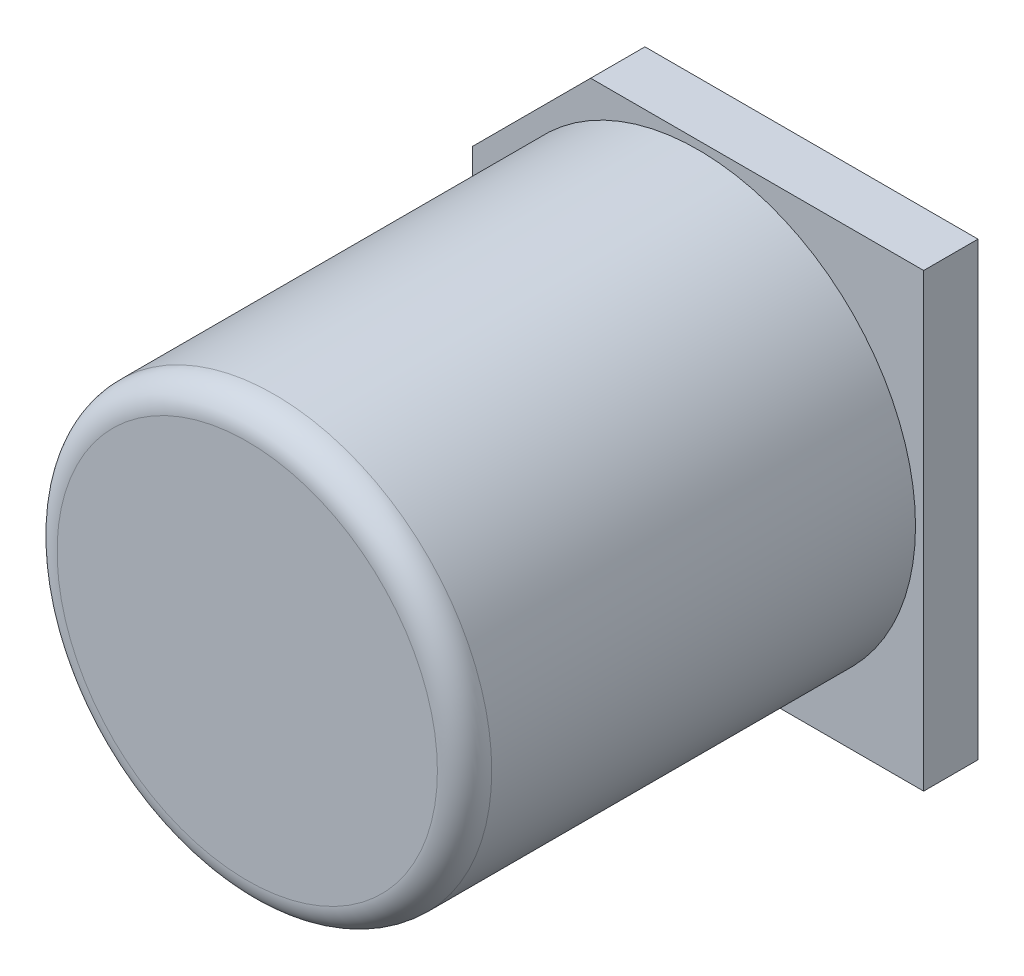
ISO-10303-21;
HEADER;
FILE_DESCRIPTION(('STEP AP214'),'2;1');
FILE_NAME('part.step','',(''),(''),'','','');
FILE_SCHEMA(('AUTOMOTIVE_DESIGN { 1 0 10303 214 1 1 1 1 }'));
ENDSEC;
DATA;
#1=APPLICATION_CONTEXT('core data for automotive mechanical design processes');
#2=APPLICATION_PROTOCOL_DEFINITION('international standard','automotive_design',2000,#1);
#3=PRODUCT_CONTEXT('',#1,'mechanical');
#4=PRODUCT('Part','Part','',(#3));
#5=PRODUCT_RELATED_PRODUCT_CATEGORY('part','',(#4));
#6=PRODUCT_DEFINITION_FORMATION('','',#4);
#7=PRODUCT_DEFINITION_CONTEXT('part definition',#1,'design');
#8=PRODUCT_DEFINITION('design','',#6,#7);
#9=PRODUCT_DEFINITION_SHAPE('','',#8);
#10=(LENGTH_UNIT() NAMED_UNIT(*) SI_UNIT(.MILLI.,.METRE.));
#11=(NAMED_UNIT(*) PLANE_ANGLE_UNIT() SI_UNIT($,.RADIAN.));
#12=(NAMED_UNIT(*) SI_UNIT($,.STERADIAN.) SOLID_ANGLE_UNIT());
#13=UNCERTAINTY_MEASURE_WITH_UNIT(LENGTH_MEASURE(1.E-05),#10,'distance_accuracy_value','');
#14=(GEOMETRIC_REPRESENTATION_CONTEXT(3) GLOBAL_UNCERTAINTY_ASSIGNED_CONTEXT((#13)) GLOBAL_UNIT_ASSIGNED_CONTEXT((#10,
#11,#12)) REPRESENTATION_CONTEXT('',''));
#15=CARTESIAN_POINT('',(0.,0.,0.));
#16=DIRECTION('',(0.,0.,1.));
#17=DIRECTION('',(1.,0.,0.));
#18=AXIS2_PLACEMENT_3D('',#15,#16,#17);
#19=CARTESIAN_POINT('',(4.15,4.15,1.));
#20=DIRECTION('',(-1.,0.,0.));
#21=DIRECTION('',(0.,0.,1.));
#22=AXIS2_PLACEMENT_3D('',#19,#20,#21);
#23=PLANE('',#22);
#24=DIRECTION('',(0.,1.,0.));
#25=VECTOR('',#24,1.);
#26=CARTESIAN_POINT('',(4.15,4.15,0.));
#27=LINE('',#26,#25);
#28=CARTESIAN_POINT('',(4.15,-4.15,0.));
#29=VERTEX_POINT('',#28);
#30=CARTESIAN_POINT('',(4.15,4.15,0.));
#31=VERTEX_POINT('',#30);
#32=EDGE_CURVE('E132',#29,#31,#27,.T.);
#33=ORIENTED_EDGE('',*,*,#32,.T.);
#34=DIRECTION('',(0.,0.,-1.));
#35=VECTOR('',#34,1.);
#36=CARTESIAN_POINT('',(4.15,4.15,1.));
#37=LINE('',#36,#35);
#38=CARTESIAN_POINT('',(4.15,4.15,1.));
#39=VERTEX_POINT('',#38);
#40=EDGE_CURVE('E149',#39,#31,#37,.T.);
#41=ORIENTED_EDGE('',*,*,#40,.F.);
#42=DIRECTION('',(0.,1.,0.));
#43=VECTOR('',#42,1.);
#44=CARTESIAN_POINT('',(4.15,4.15,1.));
#45=LINE('',#44,#43);
#46=CARTESIAN_POINT('',(4.15,-4.15,1.));
#47=VERTEX_POINT('',#46);
#48=EDGE_CURVE('E142',#47,#39,#45,.T.);
#49=ORIENTED_EDGE('',*,*,#48,.F.);
#50=DIRECTION('',(0.,0.,-1.));
#51=VECTOR('',#50,1.);
#52=CARTESIAN_POINT('',(4.15,-4.15,1.));
#53=LINE('',#52,#51);
#54=EDGE_CURVE('E128',#47,#29,#53,.T.);
#55=ORIENTED_EDGE('',*,*,#54,.T.);
#56=EDGE_LOOP('',(#33,#41,#49,#55));
#57=FACE_BOUND('',#56,.T.);
#58=ADVANCED_FACE('F46',(#57),#23,.F.);
#59=CARTESIAN_POINT('',(4.15,4.15,1.));
#60=DIRECTION('',(0.,-1.,0.));
#61=DIRECTION('',(1.,0.,0.));
#62=AXIS2_PLACEMENT_3D('',#59,#60,#61);
#63=PLANE('',#62);
#64=DIRECTION('',(-1.,0.,0.));
#65=VECTOR('',#64,1.);
#66=CARTESIAN_POINT('',(4.15,4.15,0.));
#67=LINE('',#66,#65);
#68=CARTESIAN_POINT('',(-1.98,4.15,0.));
#69=VERTEX_POINT('',#68);
#70=EDGE_CURVE('E135',#31,#69,#67,.T.);
#71=ORIENTED_EDGE('',*,*,#70,.T.);
#72=DIRECTION('',(0.,0.,-1.));
#73=VECTOR('',#72,1.);
#74=CARTESIAN_POINT('',(-1.98,4.15,1.));
#75=LINE('',#74,#73);
#76=CARTESIAN_POINT('',(-1.98,4.15,1.));
#77=VERTEX_POINT('',#76);
#78=EDGE_CURVE('E146',#77,#69,#75,.T.);
#79=ORIENTED_EDGE('',*,*,#78,.F.);
#80=DIRECTION('',(-1.,0.,0.));
#81=VECTOR('',#80,1.);
#82=CARTESIAN_POINT('',(4.15,4.15,1.));
#83=LINE('',#82,#81);
#84=EDGE_CURVE('E101',#39,#77,#83,.T.);
#85=ORIENTED_EDGE('',*,*,#84,.F.);
#86=ORIENTED_EDGE('',*,*,#40,.T.);
#87=EDGE_LOOP('',(#71,#79,#85,#86));
#88=FACE_BOUND('',#87,.T.);
#89=ADVANCED_FACE('F162',(#88),#63,.F.);
#90=CARTESIAN_POINT('',(-1.98,4.15,1.));
#91=DIRECTION('',(0.707106781186548,-0.707106781186547,0.));
#92=DIRECTION('',(0.707106781186547,0.707106781186548,0.));
#93=AXIS2_PLACEMENT_3D('',#90,#91,#92);
#94=PLANE('',#93);
#95=DIRECTION('',(-0.707106781186547,-0.707106781186548,0.));
#96=VECTOR('',#95,1.);
#97=CARTESIAN_POINT('',(-1.98,4.15,0.));
#98=LINE('',#97,#96);
#99=CARTESIAN_POINT('',(-4.15,1.98,0.));
#100=VERTEX_POINT('',#99);
#101=EDGE_CURVE('E137',#69,#100,#98,.T.);
#102=ORIENTED_EDGE('',*,*,#101,.T.);
#103=DIRECTION('',(0.,0.,-1.));
#104=VECTOR('',#103,1.);
#105=CARTESIAN_POINT('',(-4.15,1.98,1.));
#106=LINE('',#105,#104);
#107=CARTESIAN_POINT('',(-4.15,1.98,1.));
#108=VERTEX_POINT('',#107);
#109=EDGE_CURVE('E123',#108,#100,#106,.T.);
#110=ORIENTED_EDGE('',*,*,#109,.F.);
#111=DIRECTION('',(-0.707106781186547,-0.707106781186548,0.));
#112=VECTOR('',#111,1.);
#113=CARTESIAN_POINT('',(-1.98,4.15,1.));
#114=LINE('',#113,#112);
#115=EDGE_CURVE('E114',#77,#108,#114,.T.);
#116=ORIENTED_EDGE('',*,*,#115,.F.);
#117=ORIENTED_EDGE('',*,*,#78,.T.);
#118=EDGE_LOOP('',(#102,#110,#116,#117));
#119=FACE_BOUND('',#118,.T.);
#120=ADVANCED_FACE('F165',(#119),#94,.F.);
#121=CARTESIAN_POINT('',(-4.15,1.98,1.));
#122=DIRECTION('',(1.,0.,0.));
#123=DIRECTION('',(0.,1.,0.));
#124=AXIS2_PLACEMENT_3D('',#121,#122,#123);
#125=PLANE('',#124);
#126=DIRECTION('',(0.,-1.,0.));
#127=VECTOR('',#126,1.);
#128=CARTESIAN_POINT('',(-4.15,1.98,0.));
#129=LINE('',#128,#127);
#130=CARTESIAN_POINT('',(-4.15,-1.98,0.));
#131=VERTEX_POINT('',#130);
#132=EDGE_CURVE('E122',#100,#131,#129,.T.);
#133=ORIENTED_EDGE('',*,*,#132,.T.);
#134=DIRECTION('',(0.,0.,-1.));
#135=VECTOR('',#134,1.);
#136=CARTESIAN_POINT('',(-4.15,-1.98,1.));
#137=LINE('',#136,#135);
#138=CARTESIAN_POINT('',(-4.15,-1.98,1.));
#139=VERTEX_POINT('',#138);
#140=EDGE_CURVE('E119',#139,#131,#137,.T.);
#141=ORIENTED_EDGE('',*,*,#140,.F.);
#142=DIRECTION('',(0.,-1.,0.));
#143=VECTOR('',#142,1.);
#144=CARTESIAN_POINT('',(-4.15,1.98,1.));
#145=LINE('',#144,#143);
#146=EDGE_CURVE('E108',#108,#139,#145,.T.);
#147=ORIENTED_EDGE('',*,*,#146,.F.);
#148=ORIENTED_EDGE('',*,*,#109,.T.);
#149=EDGE_LOOP('',(#133,#141,#147,#148));
#150=FACE_BOUND('',#149,.T.);
#151=ADVANCED_FACE('F120',(#150),#125,.F.);
#152=CARTESIAN_POINT('',(-1.98,-4.15,1.));
#153=DIRECTION('',(0.707106781186547,0.707106781186548,0.));
#154=DIRECTION('',(-0.707106781186548,0.707106781186547,0.));
#155=AXIS2_PLACEMENT_3D('',#152,#153,#154);
#156=PLANE('',#155);
#157=DIRECTION('',(0.707106781186548,-0.707106781186547,0.));
#158=VECTOR('',#157,1.);
#159=CARTESIAN_POINT('',(-1.98,-4.15,0.));
#160=LINE('',#159,#158);
#161=CARTESIAN_POINT('',(-1.98,-4.15,0.));
#162=VERTEX_POINT('',#161);
#163=EDGE_CURVE('E86',#131,#162,#160,.T.);
#164=ORIENTED_EDGE('',*,*,#163,.T.);
#165=DIRECTION('',(0.,0.,-1.));
#166=VECTOR('',#165,1.);
#167=CARTESIAN_POINT('',(-1.98,-4.15,1.));
#168=LINE('',#167,#166);
#169=CARTESIAN_POINT('',(-1.98,-4.15,1.));
#170=VERTEX_POINT('',#169);
#171=EDGE_CURVE('E124',#170,#162,#168,.T.);
#172=ORIENTED_EDGE('',*,*,#171,.F.);
#173=DIRECTION('',(0.707106781186548,-0.707106781186547,0.));
#174=VECTOR('',#173,1.);
#175=CARTESIAN_POINT('',(-1.98,-4.15,1.));
#176=LINE('',#175,#174);
#177=EDGE_CURVE('E112',#139,#170,#176,.T.);
#178=ORIENTED_EDGE('',*,*,#177,.F.);
#179=ORIENTED_EDGE('',*,*,#140,.T.);
#180=EDGE_LOOP('',(#164,#172,#178,#179));
#181=FACE_BOUND('',#180,.T.);
#182=ADVANCED_FACE('F126',(#181),#156,.F.);
#183=CARTESIAN_POINT('',(4.15,-4.15,1.));
#184=DIRECTION('',(0.,1.,0.));
#185=DIRECTION('',(-1.,0.,0.));
#186=AXIS2_PLACEMENT_3D('',#183,#184,#185);
#187=PLANE('',#186);
#188=DIRECTION('',(1.,0.,0.));
#189=VECTOR('',#188,1.);
#190=CARTESIAN_POINT('',(4.15,-4.15,0.));
#191=LINE('',#190,#189);
#192=EDGE_CURVE('E92',#162,#29,#191,.T.);
#193=ORIENTED_EDGE('',*,*,#192,.T.);
#194=ORIENTED_EDGE('',*,*,#54,.F.);
#195=DIRECTION('',(1.,0.,0.));
#196=VECTOR('',#195,1.);
#197=CARTESIAN_POINT('',(4.15,-4.15,1.));
#198=LINE('',#197,#196);
#199=EDGE_CURVE('E63',#170,#47,#198,.T.);
#200=ORIENTED_EDGE('',*,*,#199,.F.);
#201=ORIENTED_EDGE('',*,*,#171,.T.);
#202=EDGE_LOOP('',(#193,#194,#200,#201));
#203=FACE_BOUND('',#202,.T.);
#204=ADVANCED_FACE('F170',(#203),#187,.F.);
#205=CARTESIAN_POINT('',(0.,0.,1.));
#206=DIRECTION('',(0.,0.,-1.));
#207=DIRECTION('',(-1.,0.,0.));
#208=AXIS2_PLACEMENT_3D('',#205,#206,#207);
#209=PLANE('',#208);
#210=CARTESIAN_POINT('',(0.,0.,1.));
#211=DIRECTION('',(0.,0.,1.));
#212=DIRECTION('',(1.,0.,0.));
#213=AXIS2_PLACEMENT_3D('',#210,#211,#212);
#214=CIRCLE('',#213,4.);
#215=CARTESIAN_POINT('',(4.,0.,1.));
#216=VERTEX_POINT('',#215);
#217=EDGE_CURVE('E150',#216,#216,#214,.T.);
#218=ORIENTED_EDGE('',*,*,#217,.F.);
#219=EDGE_LOOP('',(#218));
#220=FACE_BOUND('',#219,.T.);
#221=ORIENTED_EDGE('',*,*,#48,.T.);
#222=ORIENTED_EDGE('',*,*,#84,.T.);
#223=ORIENTED_EDGE('',*,*,#115,.T.);
#224=ORIENTED_EDGE('',*,*,#146,.T.);
#225=ORIENTED_EDGE('',*,*,#177,.T.);
#226=ORIENTED_EDGE('',*,*,#199,.T.);
#227=EDGE_LOOP('',(#221,#222,#223,#224,#225,#226));
#228=FACE_BOUND('',#227,.T.);
#229=ADVANCED_FACE('F110',(#220,#228),#209,.F.);
#230=CARTESIAN_POINT('',(0.,0.,0.));
#231=DIRECTION('',(0.,0.,-1.));
#232=DIRECTION('',(-1.,0.,0.));
#233=AXIS2_PLACEMENT_3D('',#230,#231,#232);
#234=PLANE('',#233);
#235=ORIENTED_EDGE('',*,*,#32,.F.);
#236=ORIENTED_EDGE('',*,*,#192,.F.);
#237=ORIENTED_EDGE('',*,*,#163,.F.);
#238=ORIENTED_EDGE('',*,*,#132,.F.);
#239=ORIENTED_EDGE('',*,*,#101,.F.);
#240=ORIENTED_EDGE('',*,*,#70,.F.);
#241=EDGE_LOOP('',(#235,#236,#237,#238,#239,#240));
#242=FACE_BOUND('',#241,.T.);
#243=ADVANCED_FACE('F168',(#242),#234,.T.);
#244=CARTESIAN_POINT('',(0.,0.,9.3));
#245=DIRECTION('',(0.,0.,-1.));
#246=DIRECTION('',(-1.,0.,0.));
#247=AXIS2_PLACEMENT_3D('',#244,#245,#246);
#248=CYLINDRICAL_SURFACE('',#247,4.);
#249=CARTESIAN_POINT('',(0.,0.,8.8));
#250=DIRECTION('',(0.,0.,1.));
#251=DIRECTION('',(1.,0.,0.));
#252=AXIS2_PLACEMENT_3D('',#249,#250,#251);
#253=CIRCLE('',#252,4.);
#254=CARTESIAN_POINT('',(4.,0.,8.8));
#255=VERTEX_POINT('',#254);
#256=EDGE_CURVE('E13',#255,#255,#253,.F.);
#257=ORIENTED_EDGE('',*,*,#256,.T.);
#258=EDGE_LOOP('',(#257));
#259=FACE_BOUND('',#258,.T.);
#260=ORIENTED_EDGE('',*,*,#217,.T.);
#261=EDGE_LOOP('',(#260));
#262=FACE_BOUND('',#261,.T.);
#263=ADVANCED_FACE('F212',(#259,#262),#248,.T.);
#264=CARTESIAN_POINT('',(0.,0.,9.3));
#265=DIRECTION('',(0.,0.,1.));
#266=DIRECTION('',(1.,0.,0.));
#267=AXIS2_PLACEMENT_3D('',#264,#265,#266);
#268=PLANE('',#267);
#269=CARTESIAN_POINT('',(0.,0.,9.3));
#270=DIRECTION('',(0.,0.,1.));
#271=DIRECTION('',(1.,0.,0.));
#272=AXIS2_PLACEMENT_3D('',#269,#270,#271);
#273=CIRCLE('',#272,3.5);
#274=CARTESIAN_POINT('',(3.5,0.,9.3));
#275=VERTEX_POINT('',#274);
#276=EDGE_CURVE('E55',#275,#275,#273,.T.);
#277=ORIENTED_EDGE('',*,*,#276,.T.);
#278=EDGE_LOOP('',(#277));
#279=FACE_BOUND('',#278,.T.);
#280=ADVANCED_FACE('F225',(#279),#268,.T.);
#281=CARTESIAN_POINT('',(0.,0.,8.8));
#282=DIRECTION('',(0.,0.,1.));
#283=DIRECTION('',(1.,0.,0.));
#284=AXIS2_PLACEMENT_3D('',#281,#282,#283);
#285=TOROIDAL_SURFACE('',#284,3.5,0.5);
#286=ORIENTED_EDGE('',*,*,#256,.F.);
#287=EDGE_LOOP('',(#286));
#288=FACE_BOUND('',#287,.T.);
#289=ORIENTED_EDGE('',*,*,#276,.F.);
#290=EDGE_LOOP('',(#289));
#291=FACE_BOUND('',#290,.T.);
#292=ADVANCED_FACE('F48',(#288,#291),#285,.T.);
#293=CLOSED_SHELL('',(#58,#89,#120,#151,#182,#204,#229,#243,#263,#280,#292));
#294=MANIFOLD_SOLID_BREP('B2',#293);
#295=ADVANCED_BREP_SHAPE_REPRESENTATION('',(#18,#294),#14);
#296=SHAPE_DEFINITION_REPRESENTATION(#9,#295);
ENDSEC;
END-ISO-10303-21;
